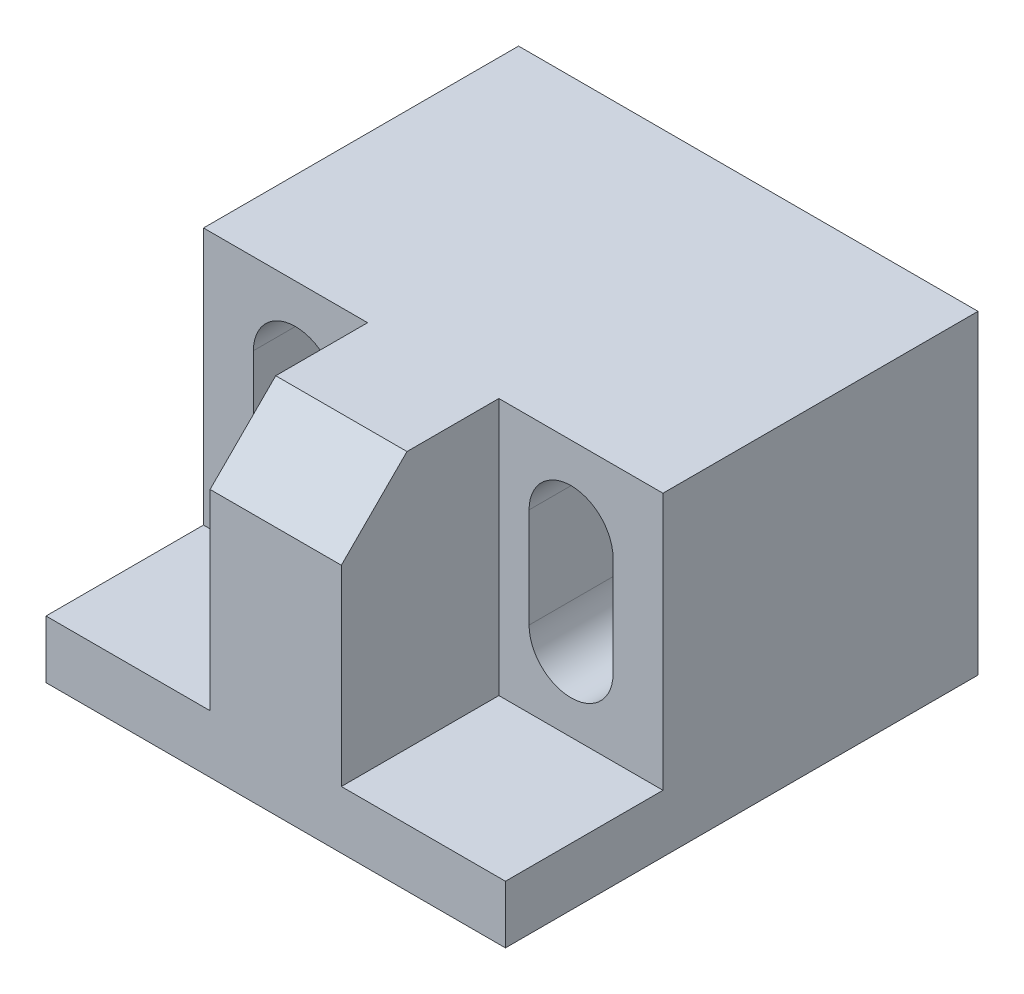
ISO-10303-21;
HEADER;
FILE_DESCRIPTION(('STEP AP214'),'2;1');
FILE_NAME('part.step','',(''),(''),'','','');
FILE_SCHEMA(('AUTOMOTIVE_DESIGN { 1 0 10303 214 1 1 1 1 }'));
ENDSEC;
DATA;
#1=APPLICATION_CONTEXT('core data for automotive mechanical design processes');
#2=APPLICATION_PROTOCOL_DEFINITION('international standard','automotive_design',2000,#1);
#3=PRODUCT_CONTEXT('',#1,'mechanical');
#4=PRODUCT('Part','Part','',(#3));
#5=PRODUCT_RELATED_PRODUCT_CATEGORY('part','',(#4));
#6=PRODUCT_DEFINITION_FORMATION('','',#4);
#7=PRODUCT_DEFINITION_CONTEXT('part definition',#1,'design');
#8=PRODUCT_DEFINITION('design','',#6,#7);
#9=PRODUCT_DEFINITION_SHAPE('','',#8);
#10=(LENGTH_UNIT() NAMED_UNIT(*) SI_UNIT(.MILLI.,.METRE.));
#11=(NAMED_UNIT(*) PLANE_ANGLE_UNIT() SI_UNIT($,.RADIAN.));
#12=(NAMED_UNIT(*) SI_UNIT($,.STERADIAN.) SOLID_ANGLE_UNIT());
#13=UNCERTAINTY_MEASURE_WITH_UNIT(LENGTH_MEASURE(1.E-05),#10,'distance_accuracy_value','');
#14=(GEOMETRIC_REPRESENTATION_CONTEXT(3) GLOBAL_UNCERTAINTY_ASSIGNED_CONTEXT((#13)) GLOBAL_UNIT_ASSIGNED_CONTEXT((#10,
#11,#12)) REPRESENTATION_CONTEXT('',''));
#15=CARTESIAN_POINT('',(0.,0.,0.));
#16=DIRECTION('',(0.,0.,1.));
#17=DIRECTION('',(1.,0.,0.));
#18=AXIS2_PLACEMENT_3D('',#15,#16,#17);
#19=CARTESIAN_POINT('',(8.75,35.4,3.25));
#20=DIRECTION('',(0.,0.,1.));
#21=DIRECTION('',(1.,0.,0.));
#22=AXIS2_PLACEMENT_3D('',#19,#20,#21);
#23=PLANE('',#22);
#24=DIRECTION('',(0.,1.,0.));
#25=VECTOR('',#24,1.);
#26=CARTESIAN_POINT('',(3.65,28.5,3.25));
#27=LINE('',#26,#25);
#28=CARTESIAN_POINT('',(3.65,28.5,3.25));
#29=VERTEX_POINT('',#28);
#30=CARTESIAN_POINT('',(3.65,32.3,3.25));
#31=VERTEX_POINT('',#30);
#32=EDGE_CURVE('E152',#29,#31,#27,.T.);
#33=ORIENTED_EDGE('',*,*,#32,.T.);
#34=CARTESIAN_POINT('',(5.25,32.3,3.25));
#35=DIRECTION('',(0.,0.,1.));
#36=DIRECTION('',(1.,0.,0.));
#37=AXIS2_PLACEMENT_3D('',#34,#35,#36);
#38=CIRCLE('',#37,1.6);
#39=CARTESIAN_POINT('',(6.85,32.3,3.25));
#40=VERTEX_POINT('',#39);
#41=EDGE_CURVE('E170',#31,#40,#38,.F.);
#42=ORIENTED_EDGE('',*,*,#41,.T.);
#43=DIRECTION('',(0.,1.,0.));
#44=VECTOR('',#43,1.);
#45=CARTESIAN_POINT('',(6.85,28.5,3.25));
#46=LINE('',#45,#44);
#47=CARTESIAN_POINT('',(6.85,28.5,3.25));
#48=VERTEX_POINT('',#47);
#49=EDGE_CURVE('E146',#40,#48,#46,.F.);
#50=ORIENTED_EDGE('',*,*,#49,.T.);
#51=CARTESIAN_POINT('',(5.25,28.5,3.25));
#52=DIRECTION('',(0.,0.,1.));
#53=DIRECTION('',(1.,0.,0.));
#54=AXIS2_PLACEMENT_3D('',#51,#52,#53);
#55=CIRCLE('',#54,1.6);
#56=EDGE_CURVE('E20',#48,#29,#55,.F.);
#57=ORIENTED_EDGE('',*,*,#56,.T.);
#58=EDGE_LOOP('',(#33,#42,#50,#57));
#59=FACE_BOUND('',#58,.T.);
#60=DIRECTION('',(0.,1.,0.));
#61=VECTOR('',#60,1.);
#62=CARTESIAN_POINT('',(2.5,35.4,3.25));
#63=LINE('',#62,#61);
#64=CARTESIAN_POINT('',(2.5,35.4,3.25));
#65=VERTEX_POINT('',#64);
#66=CARTESIAN_POINT('',(2.5,25.6,3.25));
#67=VERTEX_POINT('',#66);
#68=EDGE_CURVE('E233',#65,#67,#63,.F.);
#69=ORIENTED_EDGE('',*,*,#68,.T.);
#70=DIRECTION('',(1.,0.,0.));
#71=VECTOR('',#70,1.);
#72=CARTESIAN_POINT('',(8.75,25.6,3.25));
#73=LINE('',#72,#71);
#74=CARTESIAN_POINT('',(8.75,25.6,3.25));
#75=VERTEX_POINT('',#74);
#76=EDGE_CURVE('E226',#67,#75,#73,.T.);
#77=ORIENTED_EDGE('',*,*,#76,.T.);
#78=DIRECTION('',(0.,1.,0.));
#79=VECTOR('',#78,1.);
#80=CARTESIAN_POINT('',(8.75,35.4,3.25));
#81=LINE('',#80,#79);
#82=CARTESIAN_POINT('',(8.75,35.4,3.25));
#83=VERTEX_POINT('',#82);
#84=EDGE_CURVE('E250',#75,#83,#81,.T.);
#85=ORIENTED_EDGE('',*,*,#84,.T.);
#86=DIRECTION('',(1.,0.,0.));
#87=VECTOR('',#86,1.);
#88=CARTESIAN_POINT('',(0.,35.4,3.25));
#89=LINE('',#88,#87);
#90=EDGE_CURVE('E216',#83,#65,#89,.F.);
#91=ORIENTED_EDGE('',*,*,#90,.T.);
#92=EDGE_LOOP('',(#69,#77,#85,#91));
#93=FACE_BOUND('',#92,.T.);
#94=ADVANCED_FACE('F17',(#59,#93),#23,.T.);
#95=CARTESIAN_POINT('',(-2.5,35.4,-20.3733600993861));
#96=DIRECTION('',(1.,0.,0.));
#97=DIRECTION('',(0.,0.,-1.));
#98=AXIS2_PLACEMENT_3D('',#95,#96,#97);
#99=PLANE('',#98);
#100=DIRECTION('',(0.,0.707106781186548,-0.707106781186547));
#101=VECTOR('',#100,1.);
#102=CARTESIAN_POINT('',(-2.5,35.4,6.75000000000001));
#103=LINE('',#102,#101);
#104=CARTESIAN_POINT('',(-2.5,32.9,9.25));
#105=VERTEX_POINT('',#104);
#106=CARTESIAN_POINT('',(-2.5,35.4,6.75000000000001));
#107=VERTEX_POINT('',#106);
#108=EDGE_CURVE('E235',#105,#107,#103,.T.);
#109=ORIENTED_EDGE('',*,*,#108,.T.);
#110=DIRECTION('',(0.,0.,-1.));
#111=VECTOR('',#110,1.);
#112=CARTESIAN_POINT('',(-2.5,35.4,0.));
#113=LINE('',#112,#111);
#114=CARTESIAN_POINT('',(-2.5,35.4,3.25));
#115=VERTEX_POINT('',#114);
#116=EDGE_CURVE('E208',#107,#115,#113,.T.);
#117=ORIENTED_EDGE('',*,*,#116,.T.);
#118=DIRECTION('',(0.,1.,0.));
#119=VECTOR('',#118,1.);
#120=CARTESIAN_POINT('',(-2.5,35.4,3.25));
#121=LINE('',#120,#119);
#122=CARTESIAN_POINT('',(-2.5,25.6,3.25));
#123=VERTEX_POINT('',#122);
#124=EDGE_CURVE('E223',#123,#115,#121,.T.);
#125=ORIENTED_EDGE('',*,*,#124,.F.);
#126=DIRECTION('',(0.,0.,-1.));
#127=VECTOR('',#126,1.);
#128=CARTESIAN_POINT('',(-2.5,25.6,-20.3733600993861));
#129=LINE('',#128,#127);
#130=CARTESIAN_POINT('',(-2.5,25.6,9.25));
#131=VERTEX_POINT('',#130);
#132=EDGE_CURVE('E218',#123,#131,#129,.F.);
#133=ORIENTED_EDGE('',*,*,#132,.T.);
#134=DIRECTION('',(0.,1.,0.));
#135=VECTOR('',#134,1.);
#136=CARTESIAN_POINT('',(-2.5,35.4,9.25));
#137=LINE('',#136,#135);
#138=EDGE_CURVE('E257',#131,#105,#137,.T.);
#139=ORIENTED_EDGE('',*,*,#138,.T.);
#140=EDGE_LOOP('',(#109,#117,#125,#133,#139));
#141=FACE_BOUND('',#140,.T.);
#142=ADVANCED_FACE('F339',(#141),#99,.F.);
#143=CARTESIAN_POINT('',(0.,35.4,6.75000000000001));
#144=DIRECTION('',(0.,-0.707106781186547,-0.707106781186548));
#145=DIRECTION('',(0.,0.707106781186548,-0.707106781186547));
#146=AXIS2_PLACEMENT_3D('',#143,#144,#145);
#147=PLANE('',#146);
#148=DIRECTION('',(-1.,0.,0.));
#149=VECTOR('',#148,1.);
#150=CARTESIAN_POINT('',(8.75,32.9,9.25));
#151=LINE('',#150,#149);
#152=CARTESIAN_POINT('',(2.5,32.9,9.25));
#153=VERTEX_POINT('',#152);
#154=EDGE_CURVE('E259',#105,#153,#151,.F.);
#155=ORIENTED_EDGE('',*,*,#154,.T.);
#156=DIRECTION('',(0.,0.707106781186549,-0.707106781186546));
#157=VECTOR('',#156,1.);
#158=CARTESIAN_POINT('',(2.5,32.9,9.25));
#159=LINE('',#158,#157);
#160=CARTESIAN_POINT('',(2.5,35.4,6.75000000000001));
#161=VERTEX_POINT('',#160);
#162=EDGE_CURVE('E231',#153,#161,#159,.T.);
#163=ORIENTED_EDGE('',*,*,#162,.T.);
#164=DIRECTION('',(1.,0.,0.));
#165=VECTOR('',#164,1.);
#166=CARTESIAN_POINT('',(0.,35.4,6.75000000000001));
#167=LINE('',#166,#165);
#168=EDGE_CURVE('E210',#161,#107,#167,.F.);
#169=ORIENTED_EDGE('',*,*,#168,.T.);
#170=ORIENTED_EDGE('',*,*,#108,.F.);
#171=EDGE_LOOP('',(#155,#163,#169,#170));
#172=FACE_BOUND('',#171,.T.);
#173=ADVANCED_FACE('F335',(#172),#147,.F.);
#174=CARTESIAN_POINT('',(2.5,35.4,-20.3733600993861));
#175=DIRECTION('',(-1.,0.,0.));
#176=DIRECTION('',(0.,0.,1.));
#177=AXIS2_PLACEMENT_3D('',#174,#175,#176);
#178=PLANE('',#177);
#179=ORIENTED_EDGE('',*,*,#162,.F.);
#180=DIRECTION('',(0.,1.,0.));
#181=VECTOR('',#180,1.);
#182=CARTESIAN_POINT('',(2.5,35.4,9.25));
#183=LINE('',#182,#181);
#184=CARTESIAN_POINT('',(2.5,25.6,9.25));
#185=VERTEX_POINT('',#184);
#186=EDGE_CURVE('E261',#153,#185,#183,.F.);
#187=ORIENTED_EDGE('',*,*,#186,.T.);
#188=DIRECTION('',(0.,0.,-1.));
#189=VECTOR('',#188,1.);
#190=CARTESIAN_POINT('',(2.5,25.6,-20.3733600993861));
#191=LINE('',#190,#189);
#192=EDGE_CURVE('E228',#185,#67,#191,.T.);
#193=ORIENTED_EDGE('',*,*,#192,.T.);
#194=ORIENTED_EDGE('',*,*,#68,.F.);
#195=DIRECTION('',(0.,0.,-1.));
#196=VECTOR('',#195,1.);
#197=CARTESIAN_POINT('',(2.5,35.4,0.));
#198=LINE('',#197,#196);
#199=EDGE_CURVE('E213',#65,#161,#198,.F.);
#200=ORIENTED_EDGE('',*,*,#199,.T.);
#201=EDGE_LOOP('',(#179,#187,#193,#194,#200));
#202=FACE_BOUND('',#201,.T.);
#203=ADVANCED_FACE('F331',(#202),#178,.F.);
#204=CARTESIAN_POINT('',(8.75,25.6,-20.3733600993861));
#205=DIRECTION('',(0.,-1.,0.));
#206=DIRECTION('',(0.,0.,-1.));
#207=AXIS2_PLACEMENT_3D('',#204,#205,#206);
#208=PLANE('',#207);
#209=DIRECTION('',(0.,0.,1.));
#210=VECTOR('',#209,1.);
#211=CARTESIAN_POINT('',(8.75,25.6,-8.75));
#212=LINE('',#211,#210);
#213=CARTESIAN_POINT('',(8.75,25.6,9.25));
#214=VERTEX_POINT('',#213);
#215=EDGE_CURVE('E247',#214,#75,#212,.F.);
#216=ORIENTED_EDGE('',*,*,#215,.T.);
#217=ORIENTED_EDGE('',*,*,#76,.F.);
#218=ORIENTED_EDGE('',*,*,#192,.F.);
#219=DIRECTION('',(-1.,0.,0.));
#220=VECTOR('',#219,1.);
#221=CARTESIAN_POINT('',(8.75,25.6,9.25));
#222=LINE('',#221,#220);
#223=EDGE_CURVE('E263',#185,#214,#222,.F.);
#224=ORIENTED_EDGE('',*,*,#223,.T.);
#225=EDGE_LOOP('',(#216,#217,#218,#224));
#226=FACE_BOUND('',#225,.T.);
#227=ADVANCED_FACE('F326',(#226),#208,.F.);
#228=CARTESIAN_POINT('',(8.75,35.4,3.25));
#229=DIRECTION('',(0.,0.,1.));
#230=DIRECTION('',(1.,0.,0.));
#231=AXIS2_PLACEMENT_3D('',#228,#229,#230);
#232=PLANE('',#231);
#233=DIRECTION('',(0.,1.,0.));
#234=VECTOR('',#233,1.);
#235=CARTESIAN_POINT('',(-6.85,28.5,3.25));
#236=LINE('',#235,#234);
#237=CARTESIAN_POINT('',(-6.85,28.5,3.25));
#238=VERTEX_POINT('',#237);
#239=CARTESIAN_POINT('',(-6.85,32.3,3.25));
#240=VERTEX_POINT('',#239);
#241=EDGE_CURVE('E236',#238,#240,#236,.T.);
#242=ORIENTED_EDGE('',*,*,#241,.T.);
#243=CARTESIAN_POINT('',(-5.25,32.3,3.25));
#244=DIRECTION('',(0.,0.,1.));
#245=DIRECTION('',(1.,0.,0.));
#246=AXIS2_PLACEMENT_3D('',#243,#244,#245);
#247=CIRCLE('',#246,1.6);
#248=CARTESIAN_POINT('',(-3.65,32.3,3.25));
#249=VERTEX_POINT('',#248);
#250=EDGE_CURVE('E189',#240,#249,#247,.F.);
#251=ORIENTED_EDGE('',*,*,#250,.T.);
#252=DIRECTION('',(0.,1.,0.));
#253=VECTOR('',#252,1.);
#254=CARTESIAN_POINT('',(-3.65,28.5,3.25));
#255=LINE('',#254,#253);
#256=CARTESIAN_POINT('',(-3.65,28.5,3.25));
#257=VERTEX_POINT('',#256);
#258=EDGE_CURVE('E197',#249,#257,#255,.F.);
#259=ORIENTED_EDGE('',*,*,#258,.T.);
#260=CARTESIAN_POINT('',(-5.25,28.5,3.25));
#261=DIRECTION('',(0.,0.,1.));
#262=DIRECTION('',(1.,0.,0.));
#263=AXIS2_PLACEMENT_3D('',#260,#261,#262);
#264=CIRCLE('',#263,1.6);
#265=EDGE_CURVE('E193',#257,#238,#264,.F.);
#266=ORIENTED_EDGE('',*,*,#265,.T.);
#267=EDGE_LOOP('',(#242,#251,#259,#266));
#268=FACE_BOUND('',#267,.T.);
#269=ORIENTED_EDGE('',*,*,#124,.T.);
#270=DIRECTION('',(1.,0.,0.));
#271=VECTOR('',#270,1.);
#272=CARTESIAN_POINT('',(0.,35.4,3.25));
#273=LINE('',#272,#271);
#274=CARTESIAN_POINT('',(-8.75,35.4,3.25));
#275=VERTEX_POINT('',#274);
#276=EDGE_CURVE('E206',#115,#275,#273,.F.);
#277=ORIENTED_EDGE('',*,*,#276,.T.);
#278=DIRECTION('',(0.,1.,0.));
#279=VECTOR('',#278,1.);
#280=CARTESIAN_POINT('',(-8.75,35.4,3.25));
#281=LINE('',#280,#279);
#282=CARTESIAN_POINT('',(-8.75,25.6,3.25));
#283=VERTEX_POINT('',#282);
#284=EDGE_CURVE('E270',#275,#283,#281,.F.);
#285=ORIENTED_EDGE('',*,*,#284,.T.);
#286=DIRECTION('',(1.,0.,0.));
#287=VECTOR('',#286,1.);
#288=CARTESIAN_POINT('',(8.75,25.6,3.25));
#289=LINE('',#288,#287);
#290=EDGE_CURVE('E220',#283,#123,#289,.T.);
#291=ORIENTED_EDGE('',*,*,#290,.T.);
#292=EDGE_LOOP('',(#269,#277,#285,#291));
#293=FACE_BOUND('',#292,.T.);
#294=ADVANCED_FACE('F311',(#268,#293),#232,.T.);
#295=CARTESIAN_POINT('',(8.75,25.6,-20.3733600993861));
#296=DIRECTION('',(0.,-1.,0.));
#297=DIRECTION('',(0.,0.,-1.));
#298=AXIS2_PLACEMENT_3D('',#295,#296,#297);
#299=PLANE('',#298);
#300=DIRECTION('',(-1.,0.,0.));
#301=VECTOR('',#300,1.);
#302=CARTESIAN_POINT('',(8.75,25.6,9.25));
#303=LINE('',#302,#301);
#304=CARTESIAN_POINT('',(-8.75,25.6,9.25));
#305=VERTEX_POINT('',#304);
#306=EDGE_CURVE('E254',#305,#131,#303,.F.);
#307=ORIENTED_EDGE('',*,*,#306,.T.);
#308=ORIENTED_EDGE('',*,*,#132,.F.);
#309=ORIENTED_EDGE('',*,*,#290,.F.);
#310=DIRECTION('',(0.,0.,-1.));
#311=VECTOR('',#310,1.);
#312=CARTESIAN_POINT('',(-8.75,25.6,-8.75));
#313=LINE('',#312,#311);
#314=EDGE_CURVE('E272',#283,#305,#313,.F.);
#315=ORIENTED_EDGE('',*,*,#314,.T.);
#316=EDGE_LOOP('',(#307,#308,#309,#315));
#317=FACE_BOUND('',#316,.T.);
#318=ADVANCED_FACE('F308',(#317),#299,.F.);
#319=CARTESIAN_POINT('',(0.,35.4,0.));
#320=DIRECTION('',(0.,-1.,0.));
#321=DIRECTION('',(0.,0.,-1.));
#322=AXIS2_PLACEMENT_3D('',#319,#320,#321);
#323=PLANE('',#322);
#324=DIRECTION('',(1.,0.,0.));
#325=VECTOR('',#324,1.);
#326=CARTESIAN_POINT('',(8.75,35.4,-8.75));
#327=LINE('',#326,#325);
#328=CARTESIAN_POINT('',(8.75,35.4,-8.75));
#329=VERTEX_POINT('',#328);
#330=CARTESIAN_POINT('',(-8.75,35.4,-8.75));
#331=VERTEX_POINT('',#330);
#332=EDGE_CURVE('E279',#329,#331,#327,.F.);
#333=ORIENTED_EDGE('',*,*,#332,.T.);
#334=DIRECTION('',(0.,0.,-1.));
#335=VECTOR('',#334,1.);
#336=CARTESIAN_POINT('',(-8.75,35.4,-8.75));
#337=LINE('',#336,#335);
#338=EDGE_CURVE('E267',#331,#275,#337,.F.);
#339=ORIENTED_EDGE('',*,*,#338,.T.);
#340=ORIENTED_EDGE('',*,*,#276,.F.);
#341=ORIENTED_EDGE('',*,*,#116,.F.);
#342=ORIENTED_EDGE('',*,*,#168,.F.);
#343=ORIENTED_EDGE('',*,*,#199,.F.);
#344=ORIENTED_EDGE('',*,*,#90,.F.);
#345=DIRECTION('',(0.,0.,1.));
#346=VECTOR('',#345,1.);
#347=CARTESIAN_POINT('',(8.75,35.4,-8.75));
#348=LINE('',#347,#346);
#349=EDGE_CURVE('E252',#83,#329,#348,.F.);
#350=ORIENTED_EDGE('',*,*,#349,.T.);
#351=EDGE_LOOP('',(#333,#339,#340,#341,#342,#343,#344,#350));
#352=FACE_BOUND('',#351,.T.);
#353=ADVANCED_FACE('F340',(#352),#323,.F.);
#354=CARTESIAN_POINT('',(6.85,28.5,-8.751));
#355=DIRECTION('',(1.,0.,0.));
#356=DIRECTION('',(0.,0.,-1.));
#357=AXIS2_PLACEMENT_3D('',#354,#355,#356);
#358=PLANE('',#357);
#359=ORIENTED_EDGE('',*,*,#49,.F.);
#360=DIRECTION('',(0.,0.,1.));
#361=VECTOR('',#360,1.);
#362=CARTESIAN_POINT('',(6.85,32.3,3.25));
#363=LINE('',#362,#361);
#364=CARTESIAN_POINT('',(6.85,32.3,-8.75));
#365=VERTEX_POINT('',#364);
#366=EDGE_CURVE('E196',#40,#365,#363,.F.);
#367=ORIENTED_EDGE('',*,*,#366,.T.);
#368=DIRECTION('',(0.,1.,0.));
#369=VECTOR('',#368,1.);
#370=CARTESIAN_POINT('',(6.85,35.4,-8.75));
#371=LINE('',#370,#369);
#372=CARTESIAN_POINT('',(6.85,28.5,-8.75));
#373=VERTEX_POINT('',#372);
#374=EDGE_CURVE('E188',#365,#373,#371,.F.);
#375=ORIENTED_EDGE('',*,*,#374,.T.);
#376=DIRECTION('',(0.,0.,1.));
#377=VECTOR('',#376,1.);
#378=CARTESIAN_POINT('',(6.85,28.5,3.25));
#379=LINE('',#378,#377);
#380=EDGE_CURVE('E157',#373,#48,#379,.T.);
#381=ORIENTED_EDGE('',*,*,#380,.T.);
#382=EDGE_LOOP('',(#359,#367,#375,#381));
#383=FACE_BOUND('',#382,.T.);
#384=ADVANCED_FACE('F384',(#383),#358,.F.);
#385=CARTESIAN_POINT('',(5.25,28.5,3.25));
#386=DIRECTION('',(0.,0.,1.));
#387=DIRECTION('',(1.,0.,0.));
#388=AXIS2_PLACEMENT_3D('',#385,#386,#387);
#389=CYLINDRICAL_SURFACE('',#388,1.6);
#390=ORIENTED_EDGE('',*,*,#56,.F.);
#391=ORIENTED_EDGE('',*,*,#380,.F.);
#392=CARTESIAN_POINT('',(5.25,28.5,-8.75));
#393=DIRECTION('',(0.,0.,1.));
#394=DIRECTION('',(1.,0.,0.));
#395=AXIS2_PLACEMENT_3D('',#392,#393,#394);
#396=CIRCLE('',#395,1.6);
#397=CARTESIAN_POINT('',(3.65,28.5,-8.75));
#398=VERTEX_POINT('',#397);
#399=EDGE_CURVE('E161',#373,#398,#396,.F.);
#400=ORIENTED_EDGE('',*,*,#399,.T.);
#401=DIRECTION('',(0.,0.,1.));
#402=VECTOR('',#401,1.);
#403=CARTESIAN_POINT('',(3.65,28.5,3.25));
#404=LINE('',#403,#402);
#405=EDGE_CURVE('E156',#398,#29,#404,.T.);
#406=ORIENTED_EDGE('',*,*,#405,.T.);
#407=EDGE_LOOP('',(#390,#391,#400,#406));
#408=FACE_BOUND('',#407,.T.);
#409=ADVANCED_FACE('F159',(#408),#389,.F.);
#410=CARTESIAN_POINT('',(3.65,28.5,3.25));
#411=DIRECTION('',(-1.,0.,0.));
#412=DIRECTION('',(0.,0.,1.));
#413=AXIS2_PLACEMENT_3D('',#410,#411,#412);
#414=PLANE('',#413);
#415=ORIENTED_EDGE('',*,*,#32,.F.);
#416=ORIENTED_EDGE('',*,*,#405,.F.);
#417=DIRECTION('',(0.,1.,0.));
#418=VECTOR('',#417,1.);
#419=CARTESIAN_POINT('',(3.65,35.4,-8.75));
#420=LINE('',#419,#418);
#421=CARTESIAN_POINT('',(3.65,32.3,-8.75));
#422=VERTEX_POINT('',#421);
#423=EDGE_CURVE('E186',#398,#422,#420,.T.);
#424=ORIENTED_EDGE('',*,*,#423,.T.);
#425=DIRECTION('',(0.,0.,1.));
#426=VECTOR('',#425,1.);
#427=CARTESIAN_POINT('',(3.65,32.3,3.25));
#428=LINE('',#427,#426);
#429=EDGE_CURVE('E167',#422,#31,#428,.T.);
#430=ORIENTED_EDGE('',*,*,#429,.T.);
#431=EDGE_LOOP('',(#415,#416,#424,#430));
#432=FACE_BOUND('',#431,.T.);
#433=ADVANCED_FACE('F165',(#432),#414,.F.);
#434=CARTESIAN_POINT('',(5.25,32.3,3.25));
#435=DIRECTION('',(0.,0.,1.));
#436=DIRECTION('',(1.,0.,0.));
#437=AXIS2_PLACEMENT_3D('',#434,#435,#436);
#438=CYLINDRICAL_SURFACE('',#437,1.6);
#439=ORIENTED_EDGE('',*,*,#41,.F.);
#440=ORIENTED_EDGE('',*,*,#429,.F.);
#441=CARTESIAN_POINT('',(5.25,32.3,-8.75));
#442=DIRECTION('',(0.,0.,1.));
#443=DIRECTION('',(1.,0.,0.));
#444=AXIS2_PLACEMENT_3D('',#441,#442,#443);
#445=CIRCLE('',#444,1.6);
#446=EDGE_CURVE('E183',#422,#365,#445,.F.);
#447=ORIENTED_EDGE('',*,*,#446,.T.);
#448=ORIENTED_EDGE('',*,*,#366,.F.);
#449=EDGE_LOOP('',(#439,#440,#447,#448));
#450=FACE_BOUND('',#449,.T.);
#451=ADVANCED_FACE('F375',(#450),#438,.F.);
#452=CARTESIAN_POINT('',(-3.65,28.5,-8.751));
#453=DIRECTION('',(1.,0.,0.));
#454=DIRECTION('',(0.,0.,-1.));
#455=AXIS2_PLACEMENT_3D('',#452,#453,#454);
#456=PLANE('',#455);
#457=ORIENTED_EDGE('',*,*,#258,.F.);
#458=DIRECTION('',(0.,0.,1.));
#459=VECTOR('',#458,1.);
#460=CARTESIAN_POINT('',(-3.65,32.3,3.25));
#461=LINE('',#460,#459);
#462=CARTESIAN_POINT('',(-3.65,32.3,-8.75));
#463=VERTEX_POINT('',#462);
#464=EDGE_CURVE('E191',#249,#463,#461,.F.);
#465=ORIENTED_EDGE('',*,*,#464,.T.);
#466=DIRECTION('',(0.,1.,0.));
#467=VECTOR('',#466,1.);
#468=CARTESIAN_POINT('',(-3.65,35.4,-8.75));
#469=LINE('',#468,#467);
#470=CARTESIAN_POINT('',(-3.65,28.5,-8.75));
#471=VERTEX_POINT('',#470);
#472=EDGE_CURVE('E182',#463,#471,#469,.F.);
#473=ORIENTED_EDGE('',*,*,#472,.T.);
#474=DIRECTION('',(0.,0.,1.));
#475=VECTOR('',#474,1.);
#476=CARTESIAN_POINT('',(-3.65,28.5,3.25));
#477=LINE('',#476,#475);
#478=EDGE_CURVE('E195',#471,#257,#477,.T.);
#479=ORIENTED_EDGE('',*,*,#478,.T.);
#480=EDGE_LOOP('',(#457,#465,#473,#479));
#481=FACE_BOUND('',#480,.T.);
#482=ADVANCED_FACE('F372',(#481),#456,.F.);
#483=CARTESIAN_POINT('',(-5.25,28.5,3.25));
#484=DIRECTION('',(0.,0.,1.));
#485=DIRECTION('',(1.,0.,0.));
#486=AXIS2_PLACEMENT_3D('',#483,#484,#485);
#487=CYLINDRICAL_SURFACE('',#486,1.6);
#488=ORIENTED_EDGE('',*,*,#265,.F.);
#489=ORIENTED_EDGE('',*,*,#478,.F.);
#490=CARTESIAN_POINT('',(-5.25,28.5,-8.75));
#491=DIRECTION('',(0.,0.,1.));
#492=DIRECTION('',(1.,0.,0.));
#493=AXIS2_PLACEMENT_3D('',#490,#491,#492);
#494=CIRCLE('',#493,1.6);
#495=CARTESIAN_POINT('',(-6.85,28.5,-8.75));
#496=VERTEX_POINT('',#495);
#497=EDGE_CURVE('E180',#471,#496,#494,.F.);
#498=ORIENTED_EDGE('',*,*,#497,.T.);
#499=DIRECTION('',(0.,0.,1.));
#500=VECTOR('',#499,1.);
#501=CARTESIAN_POINT('',(-6.85,28.5,3.25));
#502=LINE('',#501,#500);
#503=EDGE_CURVE('E194',#496,#238,#502,.T.);
#504=ORIENTED_EDGE('',*,*,#503,.T.);
#505=EDGE_LOOP('',(#488,#489,#498,#504));
#506=FACE_BOUND('',#505,.T.);
#507=ADVANCED_FACE('F368',(#506),#487,.F.);
#508=CARTESIAN_POINT('',(-6.85,28.5,3.25));
#509=DIRECTION('',(-1.,0.,0.));
#510=DIRECTION('',(0.,0.,1.));
#511=AXIS2_PLACEMENT_3D('',#508,#509,#510);
#512=PLANE('',#511);
#513=ORIENTED_EDGE('',*,*,#241,.F.);
#514=ORIENTED_EDGE('',*,*,#503,.F.);
#515=DIRECTION('',(0.,1.,0.));
#516=VECTOR('',#515,1.);
#517=CARTESIAN_POINT('',(-6.85,35.4,-8.75));
#518=LINE('',#517,#516);
#519=CARTESIAN_POINT('',(-6.85,32.3,-8.75));
#520=VERTEX_POINT('',#519);
#521=EDGE_CURVE('E179',#496,#520,#518,.T.);
#522=ORIENTED_EDGE('',*,*,#521,.T.);
#523=DIRECTION('',(0.,0.,1.));
#524=VECTOR('',#523,1.);
#525=CARTESIAN_POINT('',(-6.85,32.3,3.25));
#526=LINE('',#525,#524);
#527=EDGE_CURVE('E192',#520,#240,#526,.T.);
#528=ORIENTED_EDGE('',*,*,#527,.T.);
#529=EDGE_LOOP('',(#513,#514,#522,#528));
#530=FACE_BOUND('',#529,.T.);
#531=ADVANCED_FACE('F364',(#530),#512,.F.);
#532=CARTESIAN_POINT('',(-5.25,32.3,3.25));
#533=DIRECTION('',(0.,0.,1.));
#534=DIRECTION('',(1.,0.,0.));
#535=AXIS2_PLACEMENT_3D('',#532,#533,#534);
#536=CYLINDRICAL_SURFACE('',#535,1.6);
#537=ORIENTED_EDGE('',*,*,#250,.F.);
#538=ORIENTED_EDGE('',*,*,#527,.F.);
#539=CARTESIAN_POINT('',(-5.25,32.3,-8.75));
#540=DIRECTION('',(0.,0.,1.));
#541=DIRECTION('',(1.,0.,0.));
#542=AXIS2_PLACEMENT_3D('',#539,#540,#541);
#543=CIRCLE('',#542,1.6);
#544=EDGE_CURVE('E175',#520,#463,#543,.F.);
#545=ORIENTED_EDGE('',*,*,#544,.T.);
#546=ORIENTED_EDGE('',*,*,#464,.F.);
#547=EDGE_LOOP('',(#537,#538,#545,#546));
#548=FACE_BOUND('',#547,.T.);
#549=ADVANCED_FACE('F361',(#548),#536,.F.);
#550=CARTESIAN_POINT('',(8.75,35.4,-8.75));
#551=DIRECTION('',(-1.,0.,0.));
#552=DIRECTION('',(0.,0.,1.));
#553=AXIS2_PLACEMENT_3D('',#550,#551,#552);
#554=PLANE('',#553);
#555=ORIENTED_EDGE('',*,*,#349,.F.);
#556=ORIENTED_EDGE('',*,*,#84,.F.);
#557=ORIENTED_EDGE('',*,*,#215,.F.);
#558=DIRECTION('',(0.,1.,0.));
#559=VECTOR('',#558,1.);
#560=CARTESIAN_POINT('',(8.75,35.4,9.25));
#561=LINE('',#560,#559);
#562=CARTESIAN_POINT('',(8.75,23.4,9.25));
#563=VERTEX_POINT('',#562);
#564=EDGE_CURVE('E265',#214,#563,#561,.F.);
#565=ORIENTED_EDGE('',*,*,#564,.T.);
#566=DIRECTION('',(0.,0.,-1.));
#567=VECTOR('',#566,1.);
#568=CARTESIAN_POINT('',(8.75,23.4,0.));
#569=LINE('',#568,#567);
#570=CARTESIAN_POINT('',(8.75,23.4,-8.75));
#571=VERTEX_POINT('',#570);
#572=EDGE_CURVE('E178',#571,#563,#569,.F.);
#573=ORIENTED_EDGE('',*,*,#572,.F.);
#574=DIRECTION('',(0.,1.,0.));
#575=VECTOR('',#574,1.);
#576=CARTESIAN_POINT('',(8.75,35.4,-8.75));
#577=LINE('',#576,#575);
#578=EDGE_CURVE('E276',#571,#329,#577,.T.);
#579=ORIENTED_EDGE('',*,*,#578,.T.);
#580=EDGE_LOOP('',(#555,#556,#557,#565,#573,#579));
#581=FACE_BOUND('',#580,.T.);
#582=ADVANCED_FACE('F320',(#581),#554,.F.);
#583=CARTESIAN_POINT('',(8.75,35.4,9.25));
#584=DIRECTION('',(0.,0.,-1.));
#585=DIRECTION('',(-1.,0.,0.));
#586=AXIS2_PLACEMENT_3D('',#583,#584,#585);
#587=PLANE('',#586);
#588=ORIENTED_EDGE('',*,*,#223,.F.);
#589=ORIENTED_EDGE('',*,*,#186,.F.);
#590=ORIENTED_EDGE('',*,*,#154,.F.);
#591=ORIENTED_EDGE('',*,*,#138,.F.);
#592=ORIENTED_EDGE('',*,*,#306,.F.);
#593=DIRECTION('',(0.,1.,0.));
#594=VECTOR('',#593,1.);
#595=CARTESIAN_POINT('',(-8.75,35.4,9.25));
#596=LINE('',#595,#594);
#597=CARTESIAN_POINT('',(-8.75,23.4,9.25));
#598=VERTEX_POINT('',#597);
#599=EDGE_CURVE('E274',#305,#598,#596,.F.);
#600=ORIENTED_EDGE('',*,*,#599,.T.);
#601=DIRECTION('',(1.,0.,0.));
#602=VECTOR('',#601,1.);
#603=CARTESIAN_POINT('',(0.,23.4,9.25));
#604=LINE('',#603,#602);
#605=EDGE_CURVE('E288',#563,#598,#604,.F.);
#606=ORIENTED_EDGE('',*,*,#605,.F.);
#607=ORIENTED_EDGE('',*,*,#564,.F.);
#608=EDGE_LOOP('',(#588,#589,#590,#591,#592,#600,#606,#607));
#609=FACE_BOUND('',#608,.T.);
#610=ADVANCED_FACE('F302',(#609),#587,.F.);
#611=CARTESIAN_POINT('',(-8.75,35.4,-8.75));
#612=DIRECTION('',(1.,0.,0.));
#613=DIRECTION('',(0.,0.,-1.));
#614=AXIS2_PLACEMENT_3D('',#611,#612,#613);
#615=PLANE('',#614);
#616=ORIENTED_EDGE('',*,*,#314,.F.);
#617=ORIENTED_EDGE('',*,*,#284,.F.);
#618=ORIENTED_EDGE('',*,*,#338,.F.);
#619=DIRECTION('',(0.,1.,0.));
#620=VECTOR('',#619,1.);
#621=CARTESIAN_POINT('',(-8.75,35.4,-8.75));
#622=LINE('',#621,#620);
#623=CARTESIAN_POINT('',(-8.75,23.4,-8.75));
#624=VERTEX_POINT('',#623);
#625=EDGE_CURVE('E35',#331,#624,#622,.F.);
#626=ORIENTED_EDGE('',*,*,#625,.T.);
#627=DIRECTION('',(0.,0.,-1.));
#628=VECTOR('',#627,1.);
#629=CARTESIAN_POINT('',(-8.75,23.4,0.));
#630=LINE('',#629,#628);
#631=EDGE_CURVE('E26',#598,#624,#630,.T.);
#632=ORIENTED_EDGE('',*,*,#631,.F.);
#633=ORIENTED_EDGE('',*,*,#599,.F.);
#634=EDGE_LOOP('',(#616,#617,#618,#626,#632,#633));
#635=FACE_BOUND('',#634,.T.);
#636=ADVANCED_FACE('F297',(#635),#615,.F.);
#637=CARTESIAN_POINT('',(8.75,35.4,-8.75));
#638=DIRECTION('',(0.,0.,1.));
#639=DIRECTION('',(1.,0.,0.));
#640=AXIS2_PLACEMENT_3D('',#637,#638,#639);
#641=PLANE('',#640);
#642=ORIENTED_EDGE('',*,*,#521,.F.);
#643=ORIENTED_EDGE('',*,*,#497,.F.);
#644=ORIENTED_EDGE('',*,*,#472,.F.);
#645=ORIENTED_EDGE('',*,*,#544,.F.);
#646=EDGE_LOOP('',(#642,#643,#644,#645));
#647=FACE_BOUND('',#646,.T.);
#648=ORIENTED_EDGE('',*,*,#423,.F.);
#649=ORIENTED_EDGE('',*,*,#399,.F.);
#650=ORIENTED_EDGE('',*,*,#374,.F.);
#651=ORIENTED_EDGE('',*,*,#446,.F.);
#652=EDGE_LOOP('',(#648,#649,#650,#651));
#653=FACE_BOUND('',#652,.T.);
#654=ORIENTED_EDGE('',*,*,#332,.F.);
#655=ORIENTED_EDGE('',*,*,#578,.F.);
#656=DIRECTION('',(1.,0.,0.));
#657=VECTOR('',#656,1.);
#658=CARTESIAN_POINT('',(0.,23.4,-8.75));
#659=LINE('',#658,#657);
#660=EDGE_CURVE('E11',#624,#571,#659,.T.);
#661=ORIENTED_EDGE('',*,*,#660,.F.);
#662=ORIENTED_EDGE('',*,*,#625,.F.);
#663=EDGE_LOOP('',(#654,#655,#661,#662));
#664=FACE_BOUND('',#663,.T.);
#665=ADVANCED_FACE('F316',(#647,#653,#664),#641,.F.);
#666=CARTESIAN_POINT('',(0.,23.4,0.));
#667=DIRECTION('',(0.,-1.,0.));
#668=DIRECTION('',(0.,0.,-1.));
#669=AXIS2_PLACEMENT_3D('',#666,#667,#668);
#670=PLANE('',#669);
#671=ORIENTED_EDGE('',*,*,#631,.T.);
#672=ORIENTED_EDGE('',*,*,#660,.T.);
#673=ORIENTED_EDGE('',*,*,#572,.T.);
#674=ORIENTED_EDGE('',*,*,#605,.T.);
#675=EDGE_LOOP('',(#671,#672,#673,#674));
#676=FACE_BOUND('',#675,.T.);
#677=ADVANCED_FACE('F293',(#676),#670,.T.);
#678=CLOSED_SHELL('',(#94,#142,#173,#203,#227,#294,#318,#353,#384,#409,#433,#451,#482,#507,#531,
#549,#582,#610,#636,#665,#677));
#679=MANIFOLD_SOLID_BREP('B1',#678);
#680=ADVANCED_BREP_SHAPE_REPRESENTATION('',(#18,#679),#14);
#681=SHAPE_DEFINITION_REPRESENTATION(#9,#680);
ENDSEC;
END-ISO-10303-21;
